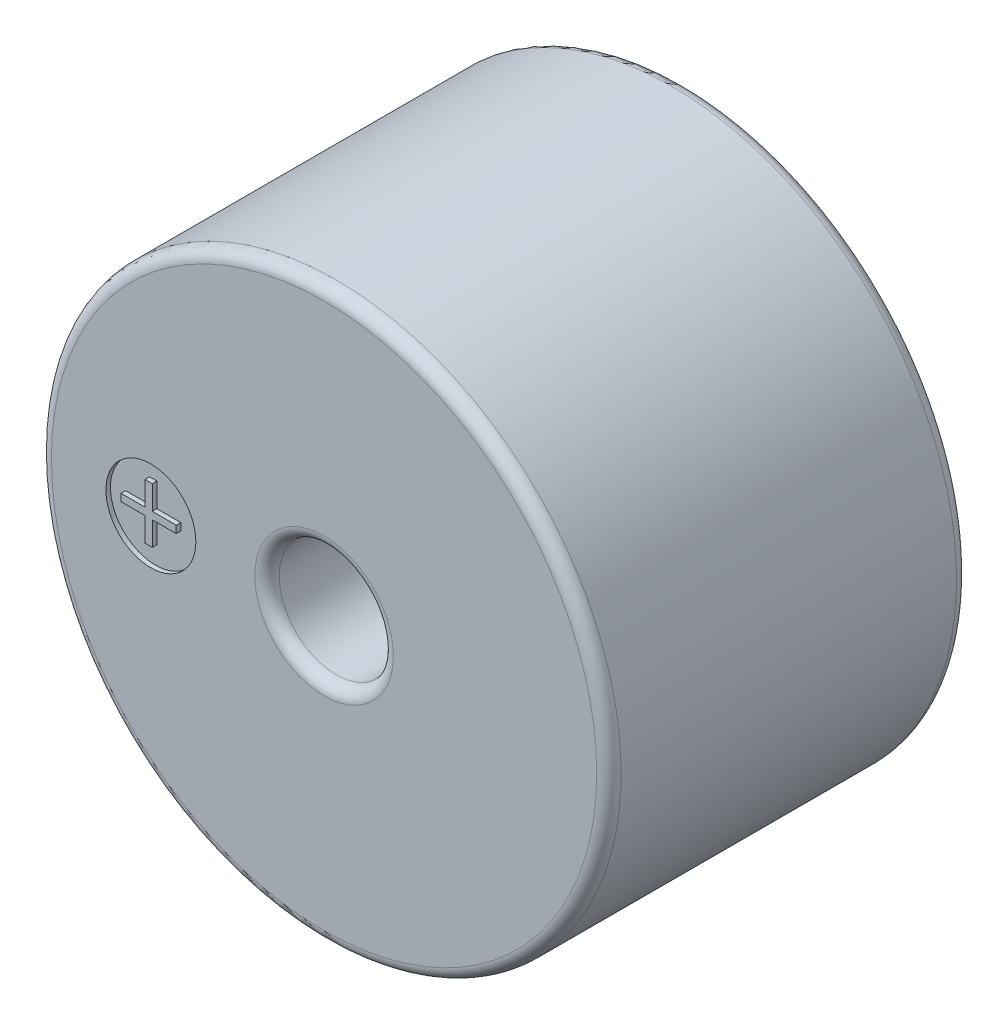
ISO-10303-21;
HEADER;
FILE_DESCRIPTION(('STEP AP214'),'2;1');
FILE_NAME('part.step','',(''),(''),'','','');
FILE_SCHEMA(('AUTOMOTIVE_DESIGN { 1 0 10303 214 1 1 1 1 }'));
ENDSEC;
DATA;
#1=APPLICATION_CONTEXT('core data for automotive mechanical design processes');
#2=APPLICATION_PROTOCOL_DEFINITION('international standard','automotive_design',2000,#1);
#3=PRODUCT_CONTEXT('',#1,'mechanical');
#4=PRODUCT('Part','Part','',(#3));
#5=PRODUCT_RELATED_PRODUCT_CATEGORY('part','',(#4));
#6=PRODUCT_DEFINITION_FORMATION('','',#4);
#7=PRODUCT_DEFINITION_CONTEXT('part definition',#1,'design');
#8=PRODUCT_DEFINITION('design','',#6,#7);
#9=PRODUCT_DEFINITION_SHAPE('','',#8);
#10=(LENGTH_UNIT() NAMED_UNIT(*) SI_UNIT(.MILLI.,.METRE.));
#11=(NAMED_UNIT(*) PLANE_ANGLE_UNIT() SI_UNIT($,.RADIAN.));
#12=(NAMED_UNIT(*) SI_UNIT($,.STERADIAN.) SOLID_ANGLE_UNIT());
#13=UNCERTAINTY_MEASURE_WITH_UNIT(LENGTH_MEASURE(1.E-05),#10,'distance_accuracy_value','');
#14=(GEOMETRIC_REPRESENTATION_CONTEXT(3) GLOBAL_UNCERTAINTY_ASSIGNED_CONTEXT((#13)) GLOBAL_UNIT_ASSIGNED_CONTEXT((#10,
#11,#12)) REPRESENTATION_CONTEXT('',''));
#15=CARTESIAN_POINT('',(0.,0.,0.));
#16=DIRECTION('',(0.,0.,1.));
#17=DIRECTION('',(1.,0.,0.));
#18=AXIS2_PLACEMENT_3D('',#15,#16,#17);
#19=CARTESIAN_POINT('',(0.,0.,6.));
#20=DIRECTION('',(0.,0.,1.));
#21=DIRECTION('',(1.,0.,0.));
#22=AXIS2_PLACEMENT_3D('',#19,#20,#21);
#23=PLANE('',#22);
#24=DIRECTION('',(1.,0.,0.));
#25=VECTOR('',#24,1.);
#26=CARTESIAN_POINT('',(-2.986624460357,0.47655981868,6.));
#27=LINE('',#26,#25);
#28=CARTESIAN_POINT('',(-2.865051818383,0.47655981868,6.));
#29=VERTEX_POINT('',#28);
#30=CARTESIAN_POINT('',(-2.986624460357,0.47655981868,6.));
#31=VERTEX_POINT('',#30);
#32=EDGE_CURVE('E139',#29,#31,#27,.F.);
#33=ORIENTED_EDGE('',*,*,#32,.T.);
#34=DIRECTION('',(0.,1.,0.));
#35=VECTOR('',#34,1.);
#36=CARTESIAN_POINT('',(-2.986624460357,0.07710685219323,6.));
#37=LINE('',#36,#35);
#38=CARTESIAN_POINT('',(-2.986624460357,0.07710685219323,6.));
#39=VERTEX_POINT('',#38);
#40=EDGE_CURVE('E123',#31,#39,#37,.F.);
#41=ORIENTED_EDGE('',*,*,#40,.T.);
#42=DIRECTION('',(1.,0.,0.));
#43=VECTOR('',#42,1.);
#44=CARTESIAN_POINT('',(-3.386077426844,0.07710685219323,6.));
#45=LINE('',#44,#43);
#46=CARTESIAN_POINT('',(-3.386077426844,0.07710685219323,6.));
#47=VERTEX_POINT('',#46);
#48=EDGE_CURVE('E128',#39,#47,#45,.F.);
#49=ORIENTED_EDGE('',*,*,#48,.T.);
#50=DIRECTION('',(0.,1.,0.));
#51=VECTOR('',#50,1.);
#52=CARTESIAN_POINT('',(-3.386077426844,-0.04446578978113,6.));
#53=LINE('',#52,#51);
#54=CARTESIAN_POINT('',(-3.386077426844,-0.04446578978113,6.));
#55=VERTEX_POINT('',#54);
#56=EDGE_CURVE('E350',#47,#55,#53,.F.);
#57=ORIENTED_EDGE('',*,*,#56,.T.);
#58=DIRECTION('',(1.,0.,0.));
#59=VECTOR('',#58,1.);
#60=CARTESIAN_POINT('',(-2.986624460357,-0.04446578978113,6.));
#61=LINE('',#60,#59);
#62=CARTESIAN_POINT('',(-2.986624460357,-0.04446578978113,6.));
#63=VERTEX_POINT('',#62);
#64=EDGE_CURVE('E355',#55,#63,#61,.T.);
#65=ORIENTED_EDGE('',*,*,#64,.T.);
#66=DIRECTION('',(0.,1.,0.));
#67=VECTOR('',#66,1.);
#68=CARTESIAN_POINT('',(-2.986624460357,-0.443918756268,6.));
#69=LINE('',#68,#67);
#70=CARTESIAN_POINT('',(-2.986624460357,-0.443918756268,6.));
#71=VERTEX_POINT('',#70);
#72=EDGE_CURVE('E360',#63,#71,#69,.F.);
#73=ORIENTED_EDGE('',*,*,#72,.T.);
#74=DIRECTION('',(1.,0.,0.));
#75=VECTOR('',#74,1.);
#76=CARTESIAN_POINT('',(-2.865051818383,-0.443918756268,6.));
#77=LINE('',#76,#75);
#78=CARTESIAN_POINT('',(-2.865051818383,-0.443918756268,6.));
#79=VERTEX_POINT('',#78);
#80=EDGE_CURVE('E365',#71,#79,#77,.T.);
#81=ORIENTED_EDGE('',*,*,#80,.T.);
#82=DIRECTION('',(0.,1.,0.));
#83=VECTOR('',#82,1.);
#84=CARTESIAN_POINT('',(-2.865051818383,-0.04446578978113,6.));
#85=LINE('',#84,#83);
#86=CARTESIAN_POINT('',(-2.865051818383,-0.04446578978113,6.));
#87=VERTEX_POINT('',#86);
#88=EDGE_CURVE('E370',#79,#87,#85,.T.);
#89=ORIENTED_EDGE('',*,*,#88,.T.);
#90=DIRECTION('',(1.,0.,0.));
#91=VECTOR('',#90,1.);
#92=CARTESIAN_POINT('',(-2.465598851896,-0.04446578978113,6.));
#93=LINE('',#92,#91);
#94=CARTESIAN_POINT('',(-2.465598851896,-0.04446578978113,6.));
#95=VERTEX_POINT('',#94);
#96=EDGE_CURVE('E375',#87,#95,#93,.T.);
#97=ORIENTED_EDGE('',*,*,#96,.T.);
#98=DIRECTION('',(0.,1.,0.));
#99=VECTOR('',#98,1.);
#100=CARTESIAN_POINT('',(-2.465598851896,0.07710685219323,6.));
#101=LINE('',#100,#99);
#102=CARTESIAN_POINT('',(-2.465598851896,0.07710685219323,6.));
#103=VERTEX_POINT('',#102);
#104=EDGE_CURVE('E380',#95,#103,#101,.T.);
#105=ORIENTED_EDGE('',*,*,#104,.T.);
#106=DIRECTION('',(1.,0.,0.));
#107=VECTOR('',#106,1.);
#108=CARTESIAN_POINT('',(-2.865051818383,0.07710685219323,6.));
#109=LINE('',#108,#107);
#110=CARTESIAN_POINT('',(-2.865051818383,0.07710685219323,6.));
#111=VERTEX_POINT('',#110);
#112=EDGE_CURVE('E385',#103,#111,#109,.F.);
#113=ORIENTED_EDGE('',*,*,#112,.T.);
#114=DIRECTION('',(0.,1.,0.));
#115=VECTOR('',#114,1.);
#116=CARTESIAN_POINT('',(-2.865051818383,0.47655981868,6.));
#117=LINE('',#116,#115);
#118=EDGE_CURVE('E390',#111,#29,#117,.T.);
#119=ORIENTED_EDGE('',*,*,#118,.T.);
#120=EDGE_LOOP('',(#33,#41,#49,#57,#65,#73,#81,#89,#97,#105,#113,#119));
#121=FACE_BOUND('',#120,.T.);
#122=ADVANCED_FACE('F17',(#121),#23,.T.);
#123=CARTESIAN_POINT('',(-3.386077426844,0.07710685219323,5.9238));
#124=DIRECTION('',(0.,-1.,0.));
#125=DIRECTION('',(0.,0.,-1.));
#126=AXIS2_PLACEMENT_3D('',#123,#124,#125);
#127=PLANE('',#126);
#128=DIRECTION('',(0.,0.,-1.));
#129=VECTOR('',#128,1.);
#130=CARTESIAN_POINT('',(-2.986624460357,0.07710685219323,5.9238));
#131=LINE('',#130,#129);
#132=CARTESIAN_POINT('',(-2.986624460357,0.07710685219323,5.9238));
#133=VERTEX_POINT('',#132);
#134=EDGE_CURVE('E130',#39,#133,#131,.T.);
#135=ORIENTED_EDGE('',*,*,#134,.T.);
#136=DIRECTION('',(1.,0.,0.));
#137=VECTOR('',#136,1.);
#138=CARTESIAN_POINT('',(-2.889,0.07710685219323,5.9238));
#139=LINE('',#138,#137);
#140=CARTESIAN_POINT('',(-3.386077426844,0.07710685219323,5.9238));
#141=VERTEX_POINT('',#140);
#142=EDGE_CURVE('E348',#141,#133,#139,.T.);
#143=ORIENTED_EDGE('',*,*,#142,.F.);
#144=DIRECTION('',(0.,0.,-1.));
#145=VECTOR('',#144,1.);
#146=CARTESIAN_POINT('',(-3.386077426844,0.07710685219323,5.9238));
#147=LINE('',#146,#145);
#148=EDGE_CURVE('E133',#141,#47,#147,.F.);
#149=ORIENTED_EDGE('',*,*,#148,.T.);
#150=ORIENTED_EDGE('',*,*,#48,.F.);
#151=EDGE_LOOP('',(#135,#143,#149,#150));
#152=FACE_BOUND('',#151,.T.);
#153=ADVANCED_FACE('F129',(#152),#127,.F.);
#154=CARTESIAN_POINT('',(-2.986624460357,0.07710685219323,5.9238));
#155=DIRECTION('',(1.,0.,0.));
#156=DIRECTION('',(0.,0.,-1.));
#157=AXIS2_PLACEMENT_3D('',#154,#155,#156);
#158=PLANE('',#157);
#159=DIRECTION('',(0.,0.,-1.));
#160=VECTOR('',#159,1.);
#161=CARTESIAN_POINT('',(-2.986624460357,0.47655981868,5.9238));
#162=LINE('',#161,#160);
#163=CARTESIAN_POINT('',(-2.986624460357,0.47655981868,5.9238));
#164=VERTEX_POINT('',#163);
#165=EDGE_CURVE('E141',#31,#164,#162,.T.);
#166=ORIENTED_EDGE('',*,*,#165,.T.);
#167=DIRECTION('',(0.,1.,0.));
#168=VECTOR('',#167,1.);
#169=CARTESIAN_POINT('',(-2.986624460357,0.,5.9238));
#170=LINE('',#169,#168);
#171=EDGE_CURVE('E145',#133,#164,#170,.T.);
#172=ORIENTED_EDGE('',*,*,#171,.F.);
#173=ORIENTED_EDGE('',*,*,#134,.F.);
#174=ORIENTED_EDGE('',*,*,#40,.F.);
#175=EDGE_LOOP('',(#166,#172,#173,#174));
#176=FACE_BOUND('',#175,.T.);
#177=ADVANCED_FACE('F143',(#176),#158,.F.);
#178=CARTESIAN_POINT('',(-2.986624460357,0.47655981868,5.9238));
#179=DIRECTION('',(0.,-1.,0.));
#180=DIRECTION('',(0.,0.,-1.));
#181=AXIS2_PLACEMENT_3D('',#178,#179,#180);
#182=PLANE('',#181);
#183=DIRECTION('',(0.,0.,1.));
#184=VECTOR('',#183,1.);
#185=CARTESIAN_POINT('',(-2.865051818383,0.47655981868,5.9238));
#186=LINE('',#185,#184);
#187=CARTESIAN_POINT('',(-2.865051818383,0.47655981868,5.9238));
#188=VERTEX_POINT('',#187);
#189=EDGE_CURVE('E392',#29,#188,#186,.F.);
#190=ORIENTED_EDGE('',*,*,#189,.T.);
#191=DIRECTION('',(1.,0.,0.));
#192=VECTOR('',#191,1.);
#193=CARTESIAN_POINT('',(-2.889,0.47655981868,5.9238));
#194=LINE('',#193,#192);
#195=EDGE_CURVE('E344',#164,#188,#194,.T.);
#196=ORIENTED_EDGE('',*,*,#195,.F.);
#197=ORIENTED_EDGE('',*,*,#165,.F.);
#198=ORIENTED_EDGE('',*,*,#32,.F.);
#199=EDGE_LOOP('',(#190,#196,#197,#198));
#200=FACE_BOUND('',#199,.T.);
#201=ADVANCED_FACE('F396',(#200),#182,.F.);
#202=CARTESIAN_POINT('',(-2.865051818383,0.47655981868,5.9238));
#203=DIRECTION('',(-1.,0.,0.));
#204=DIRECTION('',(0.,0.,1.));
#205=AXIS2_PLACEMENT_3D('',#202,#203,#204);
#206=PLANE('',#205);
#207=DIRECTION('',(0.,0.,-1.));
#208=VECTOR('',#207,1.);
#209=CARTESIAN_POINT('',(-2.865051818383,0.07710685219323,5.9238));
#210=LINE('',#209,#208);
#211=CARTESIAN_POINT('',(-2.865051818383,0.07710685219323,5.9238));
#212=VERTEX_POINT('',#211);
#213=EDGE_CURVE('E388',#111,#212,#210,.T.);
#214=ORIENTED_EDGE('',*,*,#213,.T.);
#215=DIRECTION('',(0.,1.,0.));
#216=VECTOR('',#215,1.);
#217=CARTESIAN_POINT('',(-2.865051818383,0.,5.9238));
#218=LINE('',#217,#216);
#219=EDGE_CURVE('E341',#188,#212,#218,.F.);
#220=ORIENTED_EDGE('',*,*,#219,.F.);
#221=ORIENTED_EDGE('',*,*,#189,.F.);
#222=ORIENTED_EDGE('',*,*,#118,.F.);
#223=EDGE_LOOP('',(#214,#220,#221,#222));
#224=FACE_BOUND('',#223,.T.);
#225=ADVANCED_FACE('F435',(#224),#206,.F.);
#226=CARTESIAN_POINT('',(-2.865051818383,0.07710685219323,5.9238));
#227=DIRECTION('',(0.,-1.,0.));
#228=DIRECTION('',(0.,0.,-1.));
#229=AXIS2_PLACEMENT_3D('',#226,#227,#228);
#230=PLANE('',#229);
#231=DIRECTION('',(0.,0.,1.));
#232=VECTOR('',#231,1.);
#233=CARTESIAN_POINT('',(-2.465598851896,0.07710685219323,5.9238));
#234=LINE('',#233,#232);
#235=CARTESIAN_POINT('',(-2.465598851896,0.07710685219323,5.9238));
#236=VERTEX_POINT('',#235);
#237=EDGE_CURVE('E383',#103,#236,#234,.F.);
#238=ORIENTED_EDGE('',*,*,#237,.T.);
#239=DIRECTION('',(1.,0.,0.));
#240=VECTOR('',#239,1.);
#241=CARTESIAN_POINT('',(-2.889,0.07710685219323,5.9238));
#242=LINE('',#241,#240);
#243=EDGE_CURVE('E338',#212,#236,#242,.T.);
#244=ORIENTED_EDGE('',*,*,#243,.F.);
#245=ORIENTED_EDGE('',*,*,#213,.F.);
#246=ORIENTED_EDGE('',*,*,#112,.F.);
#247=EDGE_LOOP('',(#238,#244,#245,#246));
#248=FACE_BOUND('',#247,.T.);
#249=ADVANCED_FACE('F433',(#248),#230,.F.);
#250=CARTESIAN_POINT('',(-2.465598851896,0.07710685219323,5.9238));
#251=DIRECTION('',(-1.,0.,0.));
#252=DIRECTION('',(0.,0.,1.));
#253=AXIS2_PLACEMENT_3D('',#250,#251,#252);
#254=PLANE('',#253);
#255=DIRECTION('',(0.,0.,1.));
#256=VECTOR('',#255,1.);
#257=CARTESIAN_POINT('',(-2.465598851896,-0.04446578978113,5.9238));
#258=LINE('',#257,#256);
#259=CARTESIAN_POINT('',(-2.465598851896,-0.04446578978113,5.9238));
#260=VERTEX_POINT('',#259);
#261=EDGE_CURVE('E378',#95,#260,#258,.F.);
#262=ORIENTED_EDGE('',*,*,#261,.T.);
#263=DIRECTION('',(0.,1.,0.));
#264=VECTOR('',#263,1.);
#265=CARTESIAN_POINT('',(-2.465598851896,0.,5.9238));
#266=LINE('',#265,#264);
#267=EDGE_CURVE('E335',#236,#260,#266,.F.);
#268=ORIENTED_EDGE('',*,*,#267,.F.);
#269=ORIENTED_EDGE('',*,*,#237,.F.);
#270=ORIENTED_EDGE('',*,*,#104,.F.);
#271=EDGE_LOOP('',(#262,#268,#269,#270));
#272=FACE_BOUND('',#271,.T.);
#273=ADVANCED_FACE('F428',(#272),#254,.F.);
#274=CARTESIAN_POINT('',(-2.465598851896,-0.04446578978113,5.9238));
#275=DIRECTION('',(0.,1.,0.));
#276=DIRECTION('',(0.,0.,1.));
#277=AXIS2_PLACEMENT_3D('',#274,#275,#276);
#278=PLANE('',#277);
#279=DIRECTION('',(0.,0.,1.));
#280=VECTOR('',#279,1.);
#281=CARTESIAN_POINT('',(-2.865051818383,-0.04446578978113,5.9238));
#282=LINE('',#281,#280);
#283=CARTESIAN_POINT('',(-2.865051818383,-0.04446578978113,5.9238));
#284=VERTEX_POINT('',#283);
#285=EDGE_CURVE('E373',#87,#284,#282,.F.);
#286=ORIENTED_EDGE('',*,*,#285,.T.);
#287=DIRECTION('',(1.,0.,0.));
#288=VECTOR('',#287,1.);
#289=CARTESIAN_POINT('',(-2.889,-0.04446578978113,5.9238));
#290=LINE('',#289,#288);
#291=EDGE_CURVE('E332',#260,#284,#290,.F.);
#292=ORIENTED_EDGE('',*,*,#291,.F.);
#293=ORIENTED_EDGE('',*,*,#261,.F.);
#294=ORIENTED_EDGE('',*,*,#96,.F.);
#295=EDGE_LOOP('',(#286,#292,#293,#294));
#296=FACE_BOUND('',#295,.T.);
#297=ADVANCED_FACE('F425',(#296),#278,.F.);
#298=CARTESIAN_POINT('',(-2.865051818383,-0.04446578978113,5.9238));
#299=DIRECTION('',(-1.,0.,0.));
#300=DIRECTION('',(0.,0.,1.));
#301=AXIS2_PLACEMENT_3D('',#298,#299,#300);
#302=PLANE('',#301);
#303=DIRECTION('',(0.,0.,1.));
#304=VECTOR('',#303,1.);
#305=CARTESIAN_POINT('',(-2.865051818383,-0.443918756268,5.9238));
#306=LINE('',#305,#304);
#307=CARTESIAN_POINT('',(-2.865051818383,-0.443918756268,5.9238));
#308=VERTEX_POINT('',#307);
#309=EDGE_CURVE('E368',#79,#308,#306,.F.);
#310=ORIENTED_EDGE('',*,*,#309,.T.);
#311=DIRECTION('',(0.,1.,0.));
#312=VECTOR('',#311,1.);
#313=CARTESIAN_POINT('',(-2.865051818383,0.,5.9238));
#314=LINE('',#313,#312);
#315=EDGE_CURVE('E329',#284,#308,#314,.F.);
#316=ORIENTED_EDGE('',*,*,#315,.F.);
#317=ORIENTED_EDGE('',*,*,#285,.F.);
#318=ORIENTED_EDGE('',*,*,#88,.F.);
#319=EDGE_LOOP('',(#310,#316,#317,#318));
#320=FACE_BOUND('',#319,.T.);
#321=ADVANCED_FACE('F422',(#320),#302,.F.);
#322=CARTESIAN_POINT('',(-2.865051818383,-0.443918756268,5.9238));
#323=DIRECTION('',(0.,1.,0.));
#324=DIRECTION('',(0.,0.,1.));
#325=AXIS2_PLACEMENT_3D('',#322,#323,#324);
#326=PLANE('',#325);
#327=DIRECTION('',(0.,0.,-1.));
#328=VECTOR('',#327,1.);
#329=CARTESIAN_POINT('',(-2.986624460357,-0.443918756268,5.9238));
#330=LINE('',#329,#328);
#331=CARTESIAN_POINT('',(-2.986624460357,-0.443918756268,5.9238));
#332=VERTEX_POINT('',#331);
#333=EDGE_CURVE('E363',#71,#332,#330,.T.);
#334=ORIENTED_EDGE('',*,*,#333,.T.);
#335=DIRECTION('',(1.,0.,0.));
#336=VECTOR('',#335,1.);
#337=CARTESIAN_POINT('',(-2.889,-0.443918756268,5.9238));
#338=LINE('',#337,#336);
#339=EDGE_CURVE('E326',#308,#332,#338,.F.);
#340=ORIENTED_EDGE('',*,*,#339,.F.);
#341=ORIENTED_EDGE('',*,*,#309,.F.);
#342=ORIENTED_EDGE('',*,*,#80,.F.);
#343=EDGE_LOOP('',(#334,#340,#341,#342));
#344=FACE_BOUND('',#343,.T.);
#345=ADVANCED_FACE('F416',(#344),#326,.F.);
#346=CARTESIAN_POINT('',(-2.986624460357,-0.443918756268,5.9238));
#347=DIRECTION('',(1.,0.,0.));
#348=DIRECTION('',(0.,0.,-1.));
#349=AXIS2_PLACEMENT_3D('',#346,#347,#348);
#350=PLANE('',#349);
#351=DIRECTION('',(0.,0.,1.));
#352=VECTOR('',#351,1.);
#353=CARTESIAN_POINT('',(-2.986624460357,-0.04446578978113,5.9238));
#354=LINE('',#353,#352);
#355=CARTESIAN_POINT('',(-2.986624460357,-0.04446578978113,5.9238));
#356=VERTEX_POINT('',#355);
#357=EDGE_CURVE('E358',#63,#356,#354,.F.);
#358=ORIENTED_EDGE('',*,*,#357,.T.);
#359=DIRECTION('',(0.,1.,0.));
#360=VECTOR('',#359,1.);
#361=CARTESIAN_POINT('',(-2.986624460357,0.,5.9238));
#362=LINE('',#361,#360);
#363=EDGE_CURVE('E323',#332,#356,#362,.T.);
#364=ORIENTED_EDGE('',*,*,#363,.F.);
#365=ORIENTED_EDGE('',*,*,#333,.F.);
#366=ORIENTED_EDGE('',*,*,#72,.F.);
#367=EDGE_LOOP('',(#358,#364,#365,#366));
#368=FACE_BOUND('',#367,.T.);
#369=ADVANCED_FACE('F413',(#368),#350,.F.);
#370=CARTESIAN_POINT('',(-2.986624460357,-0.04446578978113,5.9238));
#371=DIRECTION('',(0.,1.,0.));
#372=DIRECTION('',(0.,0.,1.));
#373=AXIS2_PLACEMENT_3D('',#370,#371,#372);
#374=PLANE('',#373);
#375=DIRECTION('',(0.,0.,-1.));
#376=VECTOR('',#375,1.);
#377=CARTESIAN_POINT('',(-3.386077426844,-0.04446578978113,5.9238));
#378=LINE('',#377,#376);
#379=CARTESIAN_POINT('',(-3.386077426844,-0.04446578978113,5.9238));
#380=VERTEX_POINT('',#379);
#381=EDGE_CURVE('E353',#55,#380,#378,.T.);
#382=ORIENTED_EDGE('',*,*,#381,.T.);
#383=DIRECTION('',(1.,0.,0.));
#384=VECTOR('',#383,1.);
#385=CARTESIAN_POINT('',(-2.889,-0.04446578978113,5.9238));
#386=LINE('',#385,#384);
#387=EDGE_CURVE('E320',#356,#380,#386,.F.);
#388=ORIENTED_EDGE('',*,*,#387,.F.);
#389=ORIENTED_EDGE('',*,*,#357,.F.);
#390=ORIENTED_EDGE('',*,*,#64,.F.);
#391=EDGE_LOOP('',(#382,#388,#389,#390));
#392=FACE_BOUND('',#391,.T.);
#393=ADVANCED_FACE('F410',(#392),#374,.F.);
#394=CARTESIAN_POINT('',(-3.386077426844,-0.04446578978113,5.9238));
#395=DIRECTION('',(1.,0.,0.));
#396=DIRECTION('',(0.,0.,-1.));
#397=AXIS2_PLACEMENT_3D('',#394,#395,#396);
#398=PLANE('',#397);
#399=ORIENTED_EDGE('',*,*,#148,.F.);
#400=DIRECTION('',(0.,1.,0.));
#401=VECTOR('',#400,1.);
#402=CARTESIAN_POINT('',(-3.386077426844,0.,5.9238));
#403=LINE('',#402,#401);
#404=EDGE_CURVE('E175',#380,#141,#403,.T.);
#405=ORIENTED_EDGE('',*,*,#404,.F.);
#406=ORIENTED_EDGE('',*,*,#381,.F.);
#407=ORIENTED_EDGE('',*,*,#56,.F.);
#408=EDGE_LOOP('',(#399,#405,#406,#407));
#409=FACE_BOUND('',#408,.T.);
#410=ADVANCED_FACE('F404',(#409),#398,.F.);
#411=CARTESIAN_POINT('',(0.,0.,3.46));
#412=DIRECTION('',(0.,0.,1.));
#413=DIRECTION('',(1.,0.,0.));
#414=AXIS2_PLACEMENT_3D('',#411,#412,#413);
#415=PLANE('',#414);
#416=CARTESIAN_POINT('',(0.,0.,3.46));
#417=DIRECTION('',(0.,0.,1.));
#418=DIRECTION('',(1.,0.,0.));
#419=AXIS2_PLACEMENT_3D('',#416,#417,#418);
#420=CIRCLE('',#419,0.9525);
#421=CARTESIAN_POINT('',(0.9525,0.,3.46));
#422=VERTEX_POINT('',#421);
#423=EDGE_CURVE('E172',#422,#422,#420,.T.);
#424=ORIENTED_EDGE('',*,*,#423,.T.);
#425=EDGE_LOOP('',(#424));
#426=FACE_BOUND('',#425,.T.);
#427=ADVANCED_FACE('F565',(#426),#415,.T.);
#428=CARTESIAN_POINT('',(-2.889,0.,5.9238));
#429=DIRECTION('',(0.,0.,1.));
#430=DIRECTION('',(1.,0.,0.));
#431=AXIS2_PLACEMENT_3D('',#428,#429,#430);
#432=PLANE('',#431);
#433=ORIENTED_EDGE('',*,*,#387,.T.);
#434=ORIENTED_EDGE('',*,*,#404,.T.);
#435=ORIENTED_EDGE('',*,*,#142,.T.);
#436=ORIENTED_EDGE('',*,*,#171,.T.);
#437=ORIENTED_EDGE('',*,*,#195,.T.);
#438=ORIENTED_EDGE('',*,*,#219,.T.);
#439=ORIENTED_EDGE('',*,*,#243,.T.);
#440=ORIENTED_EDGE('',*,*,#267,.T.);
#441=ORIENTED_EDGE('',*,*,#291,.T.);
#442=ORIENTED_EDGE('',*,*,#315,.T.);
#443=ORIENTED_EDGE('',*,*,#339,.T.);
#444=ORIENTED_EDGE('',*,*,#363,.T.);
#445=EDGE_LOOP('',(#433,#434,#435,#436,#437,#438,#439,#440,#441,#442,#443,#444));
#446=FACE_BOUND('',#445,.T.);
#447=CARTESIAN_POINT('',(-2.889,0.,5.9238));
#448=DIRECTION('',(0.,0.,1.));
#449=DIRECTION('',(1.,0.,0.));
#450=AXIS2_PLACEMENT_3D('',#447,#448,#449);
#451=CIRCLE('',#450,0.75);
#452=CARTESIAN_POINT('',(-2.139,0.,5.9238));
#453=VERTEX_POINT('',#452);
#454=EDGE_CURVE('E169',#453,#453,#451,.T.);
#455=ORIENTED_EDGE('',*,*,#454,.T.);
#456=EDGE_LOOP('',(#455));
#457=FACE_BOUND('',#456,.T.);
#458=ADVANCED_FACE('F400',(#446,#457),#432,.T.);
#459=CARTESIAN_POINT('',(0.,0.,3.46));
#460=DIRECTION('',(0.,0.,1.));
#461=DIRECTION('',(1.,0.,0.));
#462=AXIS2_PLACEMENT_3D('',#459,#460,#461);
#463=CYLINDRICAL_SURFACE('',#462,0.9525);
#464=CARTESIAN_POINT('',(0.,0.,5.7968));
#465=DIRECTION('',(0.,0.,1.));
#466=DIRECTION('',(1.,0.,0.));
#467=AXIS2_PLACEMENT_3D('',#464,#465,#466);
#468=CIRCLE('',#467,0.9525);
#469=CARTESIAN_POINT('',(0.9525,0.,5.7968));
#470=VERTEX_POINT('',#469);
#471=EDGE_CURVE('E168',#470,#470,#468,.F.);
#472=ORIENTED_EDGE('',*,*,#471,.F.);
#473=EDGE_LOOP('',(#472));
#474=FACE_BOUND('',#473,.T.);
#475=ORIENTED_EDGE('',*,*,#423,.F.);
#476=EDGE_LOOP('',(#475));
#477=FACE_BOUND('',#476,.T.);
#478=ADVANCED_FACE('F546',(#474,#477),#463,.F.);
#479=CARTESIAN_POINT('',(-2.,0.,-2.));
#480=DIRECTION('',(0.,0.,-1.));
#481=DIRECTION('',(-1.,0.,0.));
#482=AXIS2_PLACEMENT_3D('',#479,#480,#481);
#483=PLANE('',#482);
#484=CARTESIAN_POINT('',(-2.,0.,-2.));
#485=DIRECTION('',(0.,0.,1.));
#486=DIRECTION('',(1.,0.,0.));
#487=AXIS2_PLACEMENT_3D('',#484,#485,#486);
#488=CIRCLE('',#487,0.35);
#489=CARTESIAN_POINT('',(-1.65,0.,-2.));
#490=VERTEX_POINT('',#489);
#491=EDGE_CURVE('E165',#490,#490,#488,.T.);
#492=ORIENTED_EDGE('',*,*,#491,.F.);
#493=EDGE_LOOP('',(#492));
#494=FACE_BOUND('',#493,.T.);
#495=ADVANCED_FACE('F537',(#494),#483,.T.);
#496=CARTESIAN_POINT('',(2.,0.,-1.5));
#497=DIRECTION('',(0.,0.,-1.));
#498=DIRECTION('',(-1.,0.,0.));
#499=AXIS2_PLACEMENT_3D('',#496,#497,#498);
#500=PLANE('',#499);
#501=CARTESIAN_POINT('',(2.,0.,-1.5));
#502=DIRECTION('',(0.,0.,1.));
#503=DIRECTION('',(1.,0.,0.));
#504=AXIS2_PLACEMENT_3D('',#501,#502,#503);
#505=CIRCLE('',#504,0.3556);
#506=CARTESIAN_POINT('',(2.3556,0.,-1.5));
#507=VERTEX_POINT('',#506);
#508=EDGE_CURVE('E162',#507,#507,#505,.T.);
#509=ORIENTED_EDGE('',*,*,#508,.F.);
#510=EDGE_LOOP('',(#509));
#511=FACE_BOUND('',#510,.T.);
#512=ADVANCED_FACE('F528',(#511),#500,.T.);
#513=CARTESIAN_POINT('',(-2.889,0.,5.9238));
#514=DIRECTION('',(0.,0.,1.));
#515=DIRECTION('',(1.,0.,0.));
#516=AXIS2_PLACEMENT_3D('',#513,#514,#515);
#517=CYLINDRICAL_SURFACE('',#516,0.75);
#518=CARTESIAN_POINT('',(-2.889,0.,6.));
#519=DIRECTION('',(0.,0.,1.));
#520=DIRECTION('',(1.,0.,0.));
#521=AXIS2_PLACEMENT_3D('',#518,#519,#520);
#522=CIRCLE('',#521,0.75);
#523=CARTESIAN_POINT('',(-2.139,0.,6.));
#524=VERTEX_POINT('',#523);
#525=EDGE_CURVE('E158',#524,#524,#522,.F.);
#526=ORIENTED_EDGE('',*,*,#525,.F.);
#527=EDGE_LOOP('',(#526));
#528=FACE_BOUND('',#527,.T.);
#529=ORIENTED_EDGE('',*,*,#454,.F.);
#530=EDGE_LOOP('',(#529));
#531=FACE_BOUND('',#530,.T.);
#532=ADVANCED_FACE('F304',(#528,#531),#517,.F.);
#533=CARTESIAN_POINT('',(0.,0.,5.7968));
#534=DIRECTION('',(0.,0.,1.));
#535=DIRECTION('',(1.,0.,0.));
#536=AXIS2_PLACEMENT_3D('',#533,#534,#535);
#537=TOROIDAL_SURFACE('',#536,1.1557,0.2032);
#538=ORIENTED_EDGE('',*,*,#471,.T.);
#539=EDGE_LOOP('',(#538));
#540=FACE_BOUND('',#539,.T.);
#541=CARTESIAN_POINT('',(0.,0.,6.));
#542=DIRECTION('',(0.,0.,1.));
#543=DIRECTION('',(1.,0.,0.));
#544=AXIS2_PLACEMENT_3D('',#541,#542,#543);
#545=CIRCLE('',#544,1.1557);
#546=CARTESIAN_POINT('',(-1.1557,0.,6.));
#547=VERTEX_POINT('',#546);
#548=CARTESIAN_POINT('',(1.1557,0.,6.));
#549=VERTEX_POINT('',#548);
#550=EDGE_CURVE('E157',#547,#549,#545,.F.);
#551=ORIENTED_EDGE('',*,*,#550,.F.);
#552=CARTESIAN_POINT('',(0.,0.,6.));
#553=DIRECTION('',(0.,0.,1.));
#554=DIRECTION('',(-1.,0.,0.));
#555=AXIS2_PLACEMENT_3D('',#552,#553,#554);
#556=CIRCLE('',#555,1.1557);
#557=EDGE_CURVE('E161',#549,#547,#556,.F.);
#558=ORIENTED_EDGE('',*,*,#557,.F.);
#559=EDGE_LOOP('',(#551,#558));
#560=FACE_BOUND('',#559,.T.);
#561=ADVANCED_FACE('F298',(#540,#560),#537,.T.);
#562=CARTESIAN_POINT('',(-2.,0.,-2.));
#563=DIRECTION('',(0.,0.,1.));
#564=DIRECTION('',(1.,0.,0.));
#565=AXIS2_PLACEMENT_3D('',#562,#563,#564);
#566=CYLINDRICAL_SURFACE('',#565,0.35);
#567=ORIENTED_EDGE('',*,*,#491,.T.);
#568=EDGE_LOOP('',(#567));
#569=FACE_BOUND('',#568,.T.);
#570=CARTESIAN_POINT('',(-2.,0.,0.));
#571=DIRECTION('',(0.,0.,1.));
#572=DIRECTION('',(1.,0.,0.));
#573=AXIS2_PLACEMENT_3D('',#570,#571,#572);
#574=CIRCLE('',#573,0.35);
#575=CARTESIAN_POINT('',(-1.65,0.,0.));
#576=VERTEX_POINT('',#575);
#577=EDGE_CURVE('E154',#576,#576,#574,.F.);
#578=ORIENTED_EDGE('',*,*,#577,.T.);
#579=EDGE_LOOP('',(#578));
#580=FACE_BOUND('',#579,.T.);
#581=ADVANCED_FACE('F303',(#569,#580),#566,.T.);
#582=CARTESIAN_POINT('',(2.,0.,-1.5));
#583=DIRECTION('',(0.,0.,1.));
#584=DIRECTION('',(1.,0.,0.));
#585=AXIS2_PLACEMENT_3D('',#582,#583,#584);
#586=CYLINDRICAL_SURFACE('',#585,0.3556);
#587=ORIENTED_EDGE('',*,*,#508,.T.);
#588=EDGE_LOOP('',(#587));
#589=FACE_BOUND('',#588,.T.);
#590=CARTESIAN_POINT('',(2.,0.,0.));
#591=DIRECTION('',(0.,0.,1.));
#592=DIRECTION('',(1.,0.,0.));
#593=AXIS2_PLACEMENT_3D('',#590,#591,#592);
#594=CIRCLE('',#593,0.3556);
#595=CARTESIAN_POINT('',(2.3556,0.,0.));
#596=VERTEX_POINT('',#595);
#597=EDGE_CURVE('E150',#596,#596,#594,.F.);
#598=ORIENTED_EDGE('',*,*,#597,.T.);
#599=EDGE_LOOP('',(#598));
#600=FACE_BOUND('',#599,.T.);
#601=ADVANCED_FACE('F498',(#589,#600),#586,.T.);
#602=CARTESIAN_POINT('',(0.,0.,6.));
#603=DIRECTION('',(0.,0.,1.));
#604=DIRECTION('',(1.,0.,0.));
#605=AXIS2_PLACEMENT_3D('',#602,#603,#604);
#606=PLANE('',#605);
#607=ORIENTED_EDGE('',*,*,#557,.T.);
#608=ORIENTED_EDGE('',*,*,#550,.T.);
#609=EDGE_LOOP('',(#607,#608));
#610=FACE_BOUND('',#609,.T.);
#611=CARTESIAN_POINT('',(0.,0.,6.));
#612=DIRECTION('',(0.,0.,-1.));
#613=DIRECTION('',(-1.,0.,0.));
#614=AXIS2_PLACEMENT_3D('',#611,#612,#613);
#615=CIRCLE('',#614,4.5468);
#616=CARTESIAN_POINT('',(-4.5468,0.,6.));
#617=VERTEX_POINT('',#616);
#618=CARTESIAN_POINT('',(4.5468,0.,6.));
#619=VERTEX_POINT('',#618);
#620=EDGE_CURVE('E244',#617,#619,#615,.T.);
#621=ORIENTED_EDGE('',*,*,#620,.F.);
#622=CARTESIAN_POINT('',(0.,0.,6.));
#623=DIRECTION('',(0.,0.,-1.));
#624=DIRECTION('',(1.,0.,0.));
#625=AXIS2_PLACEMENT_3D('',#622,#623,#624);
#626=CIRCLE('',#625,4.5468);
#627=EDGE_CURVE('E153',#619,#617,#626,.T.);
#628=ORIENTED_EDGE('',*,*,#627,.F.);
#629=EDGE_LOOP('',(#621,#628));
#630=FACE_BOUND('',#629,.T.);
#631=ORIENTED_EDGE('',*,*,#525,.T.);
#632=EDGE_LOOP('',(#631));
#633=FACE_BOUND('',#632,.T.);
#634=ADVANCED_FACE('F219',(#610,#630,#633),#606,.T.);
#635=CARTESIAN_POINT('',(0.,0.,0.));
#636=DIRECTION('',(0.,0.,1.));
#637=DIRECTION('',(1.,0.,0.));
#638=AXIS2_PLACEMENT_3D('',#635,#636,#637);
#639=PLANE('',#638);
#640=ORIENTED_EDGE('',*,*,#597,.F.);
#641=EDGE_LOOP('',(#640));
#642=FACE_BOUND('',#641,.T.);
#643=CARTESIAN_POINT('',(0.,0.,0.));
#644=DIRECTION('',(0.,0.,1.));
#645=DIRECTION('',(1.,0.,0.));
#646=AXIS2_PLACEMENT_3D('',#643,#644,#645);
#647=CIRCLE('',#646,4.5468);
#648=CARTESIAN_POINT('',(4.5468,0.,0.));
#649=VERTEX_POINT('',#648);
#650=CARTESIAN_POINT('',(-4.5468,0.,0.));
#651=VERTEX_POINT('',#650);
#652=EDGE_CURVE('E206',#649,#651,#647,.T.);
#653=ORIENTED_EDGE('',*,*,#652,.F.);
#654=CARTESIAN_POINT('',(0.,0.,0.));
#655=DIRECTION('',(0.,0.,1.));
#656=DIRECTION('',(-1.,0.,0.));
#657=AXIS2_PLACEMENT_3D('',#654,#655,#656);
#658=CIRCLE('',#657,4.5468);
#659=EDGE_CURVE('E36',#651,#649,#658,.T.);
#660=ORIENTED_EDGE('',*,*,#659,.F.);
#661=EDGE_LOOP('',(#653,#660));
#662=FACE_BOUND('',#661,.T.);
#663=ORIENTED_EDGE('',*,*,#577,.F.);
#664=EDGE_LOOP('',(#663));
#665=FACE_BOUND('',#664,.T.);
#666=ADVANCED_FACE('F210',(#642,#662,#665),#639,.F.);
#667=CARTESIAN_POINT('',(0.,0.,5.7968));
#668=DIRECTION('',(0.,0.,1.));
#669=DIRECTION('',(1.,0.,0.));
#670=AXIS2_PLACEMENT_3D('',#667,#668,#669);
#671=TOROIDAL_SURFACE('',#670,4.5468,0.2032);
#672=ORIENTED_EDGE('',*,*,#627,.T.);
#673=ORIENTED_EDGE('',*,*,#620,.T.);
#674=EDGE_LOOP('',(#672,#673));
#675=FACE_BOUND('',#674,.T.);
#676=CARTESIAN_POINT('',(0.,0.,5.7968));
#677=DIRECTION('',(0.,0.,-1.));
#678=DIRECTION('',(-1.,0.,0.));
#679=AXIS2_PLACEMENT_3D('',#676,#677,#678);
#680=CIRCLE('',#679,4.75);
#681=CARTESIAN_POINT('',(-4.75,0.,5.7968));
#682=VERTEX_POINT('',#681);
#683=EDGE_CURVE('E28',#682,#682,#680,.T.);
#684=ORIENTED_EDGE('',*,*,#683,.F.);
#685=EDGE_LOOP('',(#684));
#686=FACE_BOUND('',#685,.T.);
#687=ADVANCED_FACE('F195',(#675,#686),#671,.T.);
#688=CARTESIAN_POINT('',(0.,0.,0.2032));
#689=DIRECTION('',(0.,0.,1.));
#690=DIRECTION('',(1.,0.,0.));
#691=AXIS2_PLACEMENT_3D('',#688,#689,#690);
#692=TOROIDAL_SURFACE('',#691,4.5468,0.2032);
#693=CARTESIAN_POINT('',(0.,0.,0.2032));
#694=DIRECTION('',(0.,0.,-1.));
#695=DIRECTION('',(-1.,0.,0.));
#696=AXIS2_PLACEMENT_3D('',#693,#694,#695);
#697=CIRCLE('',#696,4.75);
#698=CARTESIAN_POINT('',(-4.75,0.,0.2032));
#699=VERTEX_POINT('',#698);
#700=EDGE_CURVE('E11',#699,#699,#697,.F.);
#701=ORIENTED_EDGE('',*,*,#700,.F.);
#702=EDGE_LOOP('',(#701));
#703=FACE_BOUND('',#702,.T.);
#704=ORIENTED_EDGE('',*,*,#652,.T.);
#705=ORIENTED_EDGE('',*,*,#659,.T.);
#706=EDGE_LOOP('',(#704,#705));
#707=FACE_BOUND('',#706,.T.);
#708=ADVANCED_FACE('F183',(#703,#707),#692,.T.);
#709=CARTESIAN_POINT('',(0.,0.,6.));
#710=DIRECTION('',(0.,0.,-1.));
#711=DIRECTION('',(-1.,0.,0.));
#712=AXIS2_PLACEMENT_3D('',#709,#710,#711);
#713=CYLINDRICAL_SURFACE('',#712,4.75);
#714=ORIENTED_EDGE('',*,*,#700,.T.);
#715=EDGE_LOOP('',(#714));
#716=FACE_BOUND('',#715,.T.);
#717=ORIENTED_EDGE('',*,*,#683,.T.);
#718=EDGE_LOOP('',(#717));
#719=FACE_BOUND('',#718,.T.);
#720=ADVANCED_FACE('F194',(#716,#719),#713,.T.);
#721=CLOSED_SHELL('',(#122,#153,#177,#201,#225,#249,#273,#297,#321,#345,#369,#393,#410,#427,
#458,#478,#495,#512,#532,#561,#581,#601,#634,#666,#687,#708,#720));
#722=MANIFOLD_SOLID_BREP('B1',#721);
#723=ADVANCED_BREP_SHAPE_REPRESENTATION('',(#18,#722),#14);
#724=SHAPE_DEFINITION_REPRESENTATION(#9,#723);
ENDSEC;
END-ISO-10303-21;
